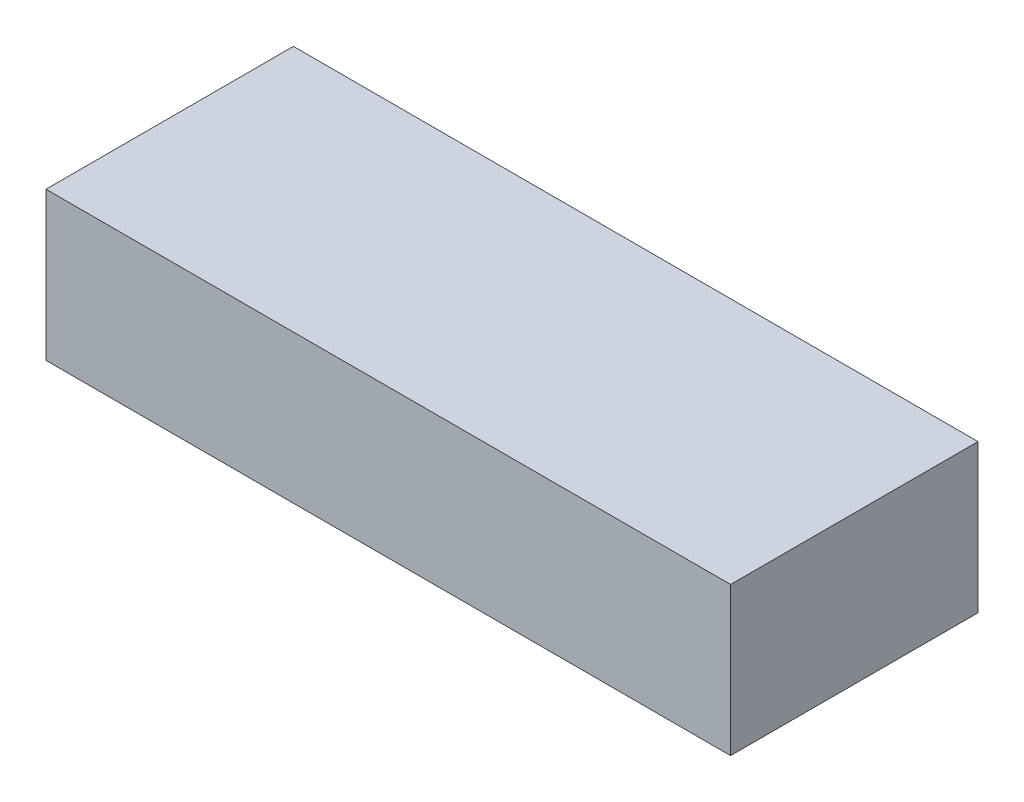
ISO-10303-21;
HEADER;
FILE_DESCRIPTION(('STEP AP214'),'2;1');
FILE_NAME('part.step','',(''),(''),'','','');
FILE_SCHEMA(('AUTOMOTIVE_DESIGN { 1 0 10303 214 1 1 1 1 }'));
ENDSEC;
DATA;
#1=APPLICATION_CONTEXT('core data for automotive mechanical design processes');
#2=APPLICATION_PROTOCOL_DEFINITION('international standard','automotive_design',2000,#1);
#3=PRODUCT_CONTEXT('',#1,'mechanical');
#4=PRODUCT('Part','Part','',(#3));
#5=PRODUCT_RELATED_PRODUCT_CATEGORY('part','',(#4));
#6=PRODUCT_DEFINITION_FORMATION('','',#4);
#7=PRODUCT_DEFINITION_CONTEXT('part definition',#1,'design');
#8=PRODUCT_DEFINITION('design','',#6,#7);
#9=PRODUCT_DEFINITION_SHAPE('','',#8);
#10=(LENGTH_UNIT() NAMED_UNIT(*) SI_UNIT(.MILLI.,.METRE.));
#11=(NAMED_UNIT(*) PLANE_ANGLE_UNIT() SI_UNIT($,.RADIAN.));
#12=(NAMED_UNIT(*) SI_UNIT($,.STERADIAN.) SOLID_ANGLE_UNIT());
#13=UNCERTAINTY_MEASURE_WITH_UNIT(LENGTH_MEASURE(1.E-05),#10,'distance_accuracy_value','');
#14=(GEOMETRIC_REPRESENTATION_CONTEXT(3) GLOBAL_UNCERTAINTY_ASSIGNED_CONTEXT((#13)) GLOBAL_UNIT_ASSIGNED_CONTEXT((#10,
#11,#12)) REPRESENTATION_CONTEXT('',''));
#15=CARTESIAN_POINT('',(0.,0.,0.));
#16=DIRECTION('',(0.,0.,1.));
#17=DIRECTION('',(1.,0.,0.));
#18=AXIS2_PLACEMENT_3D('',#15,#16,#17);
#19=CARTESIAN_POINT('',(-0.635,-0.13750036,0.45899832));
#20=DIRECTION('',(0.,0.,-1.));
#21=DIRECTION('',(0.,-1.,0.));
#22=AXIS2_PLACEMENT_3D('',#19,#20,#21);
#23=PLANE('',#22);
#24=DIRECTION('',(1.,0.,0.));
#25=VECTOR('',#24,1.);
#26=CARTESIAN_POINT('',(-0.635,-0.13750036,0.45899832));
#27=LINE('',#26,#25);
#28=CARTESIAN_POINT('',(-0.635,-0.13750036,0.45899832));
#29=VERTEX_POINT('',#28);
#30=CARTESIAN_POINT('',(0.635,-0.13750036,0.45899832));
#31=VERTEX_POINT('',#30);
#32=EDGE_CURVE('E88',#29,#31,#27,.T.);
#33=ORIENTED_EDGE('',*,*,#32,.T.);
#34=DIRECTION('',(0.,1.,0.));
#35=VECTOR('',#34,1.);
#36=CARTESIAN_POINT('',(0.635,-0.13750036,0.45899832));
#37=LINE('',#36,#35);
#38=CARTESIAN_POINT('',(0.635,0.13750036,0.45899832));
#39=VERTEX_POINT('',#38);
#40=EDGE_CURVE('E104',#31,#39,#37,.T.);
#41=ORIENTED_EDGE('',*,*,#40,.T.);
#42=DIRECTION('',(-1.,0.,0.));
#43=VECTOR('',#42,1.);
#44=CARTESIAN_POINT('',(0.635,0.13750036,0.45899832));
#45=LINE('',#44,#43);
#46=CARTESIAN_POINT('',(-0.635,0.13750036,0.45899832));
#47=VERTEX_POINT('',#46);
#48=EDGE_CURVE('E72',#39,#47,#45,.T.);
#49=ORIENTED_EDGE('',*,*,#48,.T.);
#50=DIRECTION('',(0.,-1.,0.));
#51=VECTOR('',#50,1.);
#52=CARTESIAN_POINT('',(-0.635,0.13750036,0.45899832));
#53=LINE('',#52,#51);
#54=EDGE_CURVE('E11',#47,#29,#53,.T.);
#55=ORIENTED_EDGE('',*,*,#54,.T.);
#56=EDGE_LOOP('',(#33,#41,#49,#55));
#57=FACE_BOUND('',#56,.T.);
#58=ADVANCED_FACE('F17',(#57),#23,.F.);
#59=CARTESIAN_POINT('',(-0.635,-0.13750036,0.));
#60=DIRECTION('',(0.,0.,-1.));
#61=DIRECTION('',(0.,-1.,0.));
#62=AXIS2_PLACEMENT_3D('',#59,#60,#61);
#63=PLANE('',#62);
#64=DIRECTION('',(1.,0.,0.));
#65=VECTOR('',#64,1.);
#66=CARTESIAN_POINT('',(-0.635,-0.13750036,0.));
#67=LINE('',#66,#65);
#68=CARTESIAN_POINT('',(-0.635,-0.13750036,0.));
#69=VERTEX_POINT('',#68);
#70=CARTESIAN_POINT('',(0.635,-0.13750036,0.));
#71=VERTEX_POINT('',#70);
#72=EDGE_CURVE('E76',#69,#71,#67,.T.);
#73=ORIENTED_EDGE('',*,*,#72,.F.);
#74=DIRECTION('',(0.,-1.,0.));
#75=VECTOR('',#74,1.);
#76=CARTESIAN_POINT('',(-0.635,0.13750036,0.));
#77=LINE('',#76,#75);
#78=CARTESIAN_POINT('',(-0.635,0.13750036,0.));
#79=VERTEX_POINT('',#78);
#80=EDGE_CURVE('E28',#79,#69,#77,.T.);
#81=ORIENTED_EDGE('',*,*,#80,.F.);
#82=DIRECTION('',(-1.,0.,0.));
#83=VECTOR('',#82,1.);
#84=CARTESIAN_POINT('',(0.635,0.13750036,0.));
#85=LINE('',#84,#83);
#86=CARTESIAN_POINT('',(0.635,0.13750036,0.));
#87=VERTEX_POINT('',#86);
#88=EDGE_CURVE('E113',#87,#79,#85,.T.);
#89=ORIENTED_EDGE('',*,*,#88,.F.);
#90=DIRECTION('',(0.,1.,0.));
#91=VECTOR('',#90,1.);
#92=CARTESIAN_POINT('',(0.635,-0.13750036,0.));
#93=LINE('',#92,#91);
#94=EDGE_CURVE('E79',#71,#87,#93,.T.);
#95=ORIENTED_EDGE('',*,*,#94,.F.);
#96=EDGE_LOOP('',(#73,#81,#89,#95));
#97=FACE_BOUND('',#96,.T.);
#98=ADVANCED_FACE('F77',(#97),#63,.T.);
#99=CARTESIAN_POINT('',(-0.635,0.13750036,0.));
#100=DIRECTION('',(1.,0.,0.));
#101=DIRECTION('',(0.,1.,0.));
#102=AXIS2_PLACEMENT_3D('',#99,#100,#101);
#103=PLANE('',#102);
#104=DIRECTION('',(0.,0.,1.));
#105=VECTOR('',#104,1.);
#106=CARTESIAN_POINT('',(-0.635,0.13750036,0.));
#107=LINE('',#106,#105);
#108=EDGE_CURVE('E68',#79,#47,#107,.T.);
#109=ORIENTED_EDGE('',*,*,#108,.F.);
#110=ORIENTED_EDGE('',*,*,#80,.T.);
#111=DIRECTION('',(0.,0.,1.));
#112=VECTOR('',#111,1.);
#113=CARTESIAN_POINT('',(-0.635,-0.13750036,0.));
#114=LINE('',#113,#112);
#115=EDGE_CURVE('E66',#69,#29,#114,.T.);
#116=ORIENTED_EDGE('',*,*,#115,.T.);
#117=ORIENTED_EDGE('',*,*,#54,.F.);
#118=EDGE_LOOP('',(#109,#110,#116,#117));
#119=FACE_BOUND('',#118,.T.);
#120=ADVANCED_FACE('F64',(#119),#103,.F.);
#121=CARTESIAN_POINT('',(0.635,0.13750036,0.));
#122=DIRECTION('',(0.,-1.,0.));
#123=DIRECTION('',(0.,0.,-1.));
#124=AXIS2_PLACEMENT_3D('',#121,#122,#123);
#125=PLANE('',#124);
#126=DIRECTION('',(0.,0.,1.));
#127=VECTOR('',#126,1.);
#128=CARTESIAN_POINT('',(0.635,0.13750036,0.));
#129=LINE('',#128,#127);
#130=EDGE_CURVE('E97',#87,#39,#129,.T.);
#131=ORIENTED_EDGE('',*,*,#130,.F.);
#132=ORIENTED_EDGE('',*,*,#88,.T.);
#133=ORIENTED_EDGE('',*,*,#108,.T.);
#134=ORIENTED_EDGE('',*,*,#48,.F.);
#135=EDGE_LOOP('',(#131,#132,#133,#134));
#136=FACE_BOUND('',#135,.T.);
#137=ADVANCED_FACE('F125',(#136),#125,.F.);
#138=CARTESIAN_POINT('',(0.635,-0.13750036,0.));
#139=DIRECTION('',(-1.,0.,0.));
#140=DIRECTION('',(0.,0.,1.));
#141=AXIS2_PLACEMENT_3D('',#138,#139,#140);
#142=PLANE('',#141);
#143=DIRECTION('',(0.,0.,1.));
#144=VECTOR('',#143,1.);
#145=CARTESIAN_POINT('',(0.635,-0.13750036,0.));
#146=LINE('',#145,#144);
#147=EDGE_CURVE('E21',#71,#31,#146,.T.);
#148=ORIENTED_EDGE('',*,*,#147,.F.);
#149=ORIENTED_EDGE('',*,*,#94,.T.);
#150=ORIENTED_EDGE('',*,*,#130,.T.);
#151=ORIENTED_EDGE('',*,*,#40,.F.);
#152=EDGE_LOOP('',(#148,#149,#150,#151));
#153=FACE_BOUND('',#152,.T.);
#154=ADVANCED_FACE('F19',(#153),#142,.F.);
#155=CARTESIAN_POINT('',(-0.635,-0.13750036,0.));
#156=DIRECTION('',(0.,1.,0.));
#157=DIRECTION('',(1.,0.,0.));
#158=AXIS2_PLACEMENT_3D('',#155,#156,#157);
#159=PLANE('',#158);
#160=ORIENTED_EDGE('',*,*,#115,.F.);
#161=ORIENTED_EDGE('',*,*,#72,.T.);
#162=ORIENTED_EDGE('',*,*,#147,.T.);
#163=ORIENTED_EDGE('',*,*,#32,.F.);
#164=EDGE_LOOP('',(#160,#161,#162,#163));
#165=FACE_BOUND('',#164,.T.);
#166=ADVANCED_FACE('F86',(#165),#159,.F.);
#167=CLOSED_SHELL('',(#58,#98,#120,#137,#154,#166));
#168=MANIFOLD_SOLID_BREP('B1',#167);
#169=ADVANCED_BREP_SHAPE_REPRESENTATION('',(#18,#168),#14);
#170=SHAPE_DEFINITION_REPRESENTATION(#9,#169);
ENDSEC;
END-ISO-10303-21;
